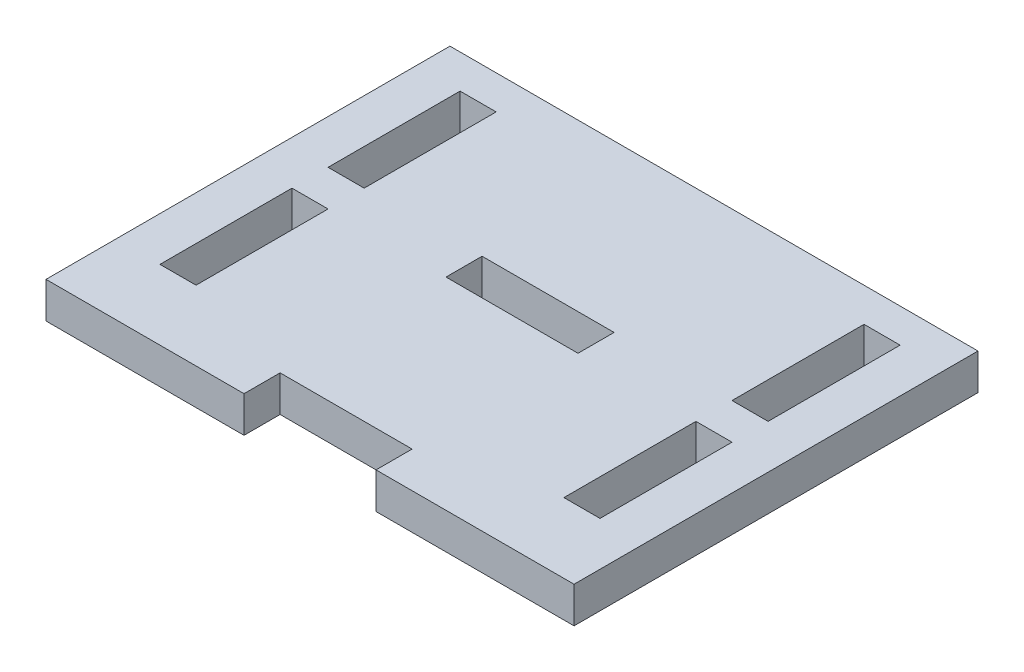
ISO-10303-21;
HEADER;
FILE_DESCRIPTION(('STEP AP214'),'2;1');
FILE_NAME('part.step','',(''),(''),'','','');
FILE_SCHEMA(('AUTOMOTIVE_DESIGN { 1 0 10303 214 1 1 1 1 }'));
ENDSEC;
DATA;
#1=APPLICATION_CONTEXT('core data for automotive mechanical design processes');
#2=APPLICATION_PROTOCOL_DEFINITION('international standard','automotive_design',2000,#1);
#3=PRODUCT_CONTEXT('',#1,'mechanical');
#4=PRODUCT('Part','Part','',(#3));
#5=PRODUCT_RELATED_PRODUCT_CATEGORY('part','',(#4));
#6=PRODUCT_DEFINITION_FORMATION('','',#4);
#7=PRODUCT_DEFINITION_CONTEXT('part definition',#1,'design');
#8=PRODUCT_DEFINITION('design','',#6,#7);
#9=PRODUCT_DEFINITION_SHAPE('','',#8);
#10=(LENGTH_UNIT() NAMED_UNIT(*) SI_UNIT(.MILLI.,.METRE.));
#11=(NAMED_UNIT(*) PLANE_ANGLE_UNIT() SI_UNIT($,.RADIAN.));
#12=(NAMED_UNIT(*) SI_UNIT($,.STERADIAN.) SOLID_ANGLE_UNIT());
#13=UNCERTAINTY_MEASURE_WITH_UNIT(LENGTH_MEASURE(1.E-05),#10,'distance_accuracy_value','');
#14=(GEOMETRIC_REPRESENTATION_CONTEXT(3) GLOBAL_UNCERTAINTY_ASSIGNED_CONTEXT((#13)) GLOBAL_UNIT_ASSIGNED_CONTEXT((#10,
#11,#12)) REPRESENTATION_CONTEXT('',''));
#15=CARTESIAN_POINT('',(0.,0.,0.));
#16=DIRECTION('',(0.,0.,1.));
#17=DIRECTION('',(1.,0.,0.));
#18=AXIS2_PLACEMENT_3D('',#15,#16,#17);
#19=CARTESIAN_POINT('',(0.,4.1,0.));
#20=DIRECTION('',(0.,1.,0.));
#21=DIRECTION('',(0.,0.,1.));
#22=AXIS2_PLACEMENT_3D('',#19,#20,#21);
#23=PLANE('',#22);
#24=DIRECTION('',(0.,0.,-1.));
#25=VECTOR('',#24,1.);
#26=CARTESIAN_POINT('',(55.,4.1,-7.94999999999999));
#27=LINE('',#26,#25);
#28=CARTESIAN_POINT('',(55.,4.1,-7.94999999999999));
#29=VERTEX_POINT('',#28);
#30=CARTESIAN_POINT('',(55.,4.1,-22.95));
#31=VERTEX_POINT('',#30);
#32=EDGE_CURVE('E255',#29,#31,#27,.T.);
#33=ORIENTED_EDGE('',*,*,#32,.F.);
#34=DIRECTION('',(1.,0.,0.));
#35=VECTOR('',#34,1.);
#36=CARTESIAN_POINT('',(55.,4.1,-7.94999999999999));
#37=LINE('',#36,#35);
#38=CARTESIAN_POINT('',(50.9,4.1,-7.94999999999999));
#39=VERTEX_POINT('',#38);
#40=EDGE_CURVE('E253',#39,#29,#37,.T.);
#41=ORIENTED_EDGE('',*,*,#40,.F.);
#42=DIRECTION('',(0.,0.,1.));
#43=VECTOR('',#42,1.);
#44=CARTESIAN_POINT('',(50.9,4.1,-7.94999999999999));
#45=LINE('',#44,#43);
#46=CARTESIAN_POINT('',(50.9,4.1,-22.95));
#47=VERTEX_POINT('',#46);
#48=EDGE_CURVE('E261',#47,#39,#45,.T.);
#49=ORIENTED_EDGE('',*,*,#48,.F.);
#50=DIRECTION('',(-1.,0.,0.));
#51=VECTOR('',#50,1.);
#52=CARTESIAN_POINT('',(55.,4.1,-22.95));
#53=LINE('',#52,#51);
#54=EDGE_CURVE('E258',#31,#47,#53,.T.);
#55=ORIENTED_EDGE('',*,*,#54,.F.);
#56=EDGE_LOOP('',(#33,#41,#49,#55));
#57=FACE_BOUND('',#56,.T.);
#58=DIRECTION('',(1.,0.,0.));
#59=VECTOR('',#58,1.);
#60=CARTESIAN_POINT('',(5.00000000000002,4.1,-7.94999999999999));
#61=LINE('',#60,#59);
#62=CARTESIAN_POINT('',(5.00000000000002,4.1,-7.94999999999999));
#63=VERTEX_POINT('',#62);
#64=CARTESIAN_POINT('',(9.10000000000001,4.1,-7.94999999999999));
#65=VERTEX_POINT('',#64);
#66=EDGE_CURVE('E317',#63,#65,#61,.T.);
#67=ORIENTED_EDGE('',*,*,#66,.F.);
#68=DIRECTION('',(0.,0.,1.));
#69=VECTOR('',#68,1.);
#70=CARTESIAN_POINT('',(5.00000000000002,4.1,-7.94999999999999));
#71=LINE('',#70,#69);
#72=CARTESIAN_POINT('',(5.,4.1,-22.95));
#73=VERTEX_POINT('',#72);
#74=EDGE_CURVE('E315',#73,#63,#71,.T.);
#75=ORIENTED_EDGE('',*,*,#74,.F.);
#76=DIRECTION('',(-1.,0.,0.));
#77=VECTOR('',#76,1.);
#78=CARTESIAN_POINT('',(5.,4.1,-22.95));
#79=LINE('',#78,#77);
#80=CARTESIAN_POINT('',(9.1,4.1,-22.95));
#81=VERTEX_POINT('',#80);
#82=EDGE_CURVE('E323',#81,#73,#79,.T.);
#83=ORIENTED_EDGE('',*,*,#82,.F.);
#84=DIRECTION('',(0.,0.,-1.));
#85=VECTOR('',#84,1.);
#86=CARTESIAN_POINT('',(9.10000000000001,4.1,-7.94999999999999));
#87=LINE('',#86,#85);
#88=EDGE_CURVE('E320',#65,#81,#87,.T.);
#89=ORIENTED_EDGE('',*,*,#88,.F.);
#90=EDGE_LOOP('',(#67,#75,#83,#89));
#91=FACE_BOUND('',#90,.T.);
#92=DIRECTION('',(1.,0.,0.));
#93=VECTOR('',#92,1.);
#94=CARTESIAN_POINT('',(22.5,4.1,0.));
#95=LINE('',#94,#93);
#96=CARTESIAN_POINT('',(0.,4.1,0.));
#97=VERTEX_POINT('',#96);
#98=CARTESIAN_POINT('',(22.5,4.1,0.));
#99=VERTEX_POINT('',#98);
#100=EDGE_CURVE('E377',#97,#99,#95,.T.);
#101=ORIENTED_EDGE('',*,*,#100,.T.);
#102=DIRECTION('',(0.,0.,-1.));
#103=VECTOR('',#102,1.);
#104=CARTESIAN_POINT('',(22.5,4.1,0.));
#105=LINE('',#104,#103);
#106=CARTESIAN_POINT('',(22.5,4.1,-4.1));
#107=VERTEX_POINT('',#106);
#108=EDGE_CURVE('E380',#99,#107,#105,.T.);
#109=ORIENTED_EDGE('',*,*,#108,.T.);
#110=DIRECTION('',(1.,0.,0.));
#111=VECTOR('',#110,1.);
#112=CARTESIAN_POINT('',(22.5,4.1,-4.1));
#113=LINE('',#112,#111);
#114=CARTESIAN_POINT('',(37.5,4.1,-4.1));
#115=VERTEX_POINT('',#114);
#116=EDGE_CURVE('E383',#107,#115,#113,.T.);
#117=ORIENTED_EDGE('',*,*,#116,.T.);
#118=DIRECTION('',(0.,0.,1.));
#119=VECTOR('',#118,1.);
#120=CARTESIAN_POINT('',(37.5,4.1,0.));
#121=LINE('',#120,#119);
#122=CARTESIAN_POINT('',(37.5,4.1,0.));
#123=VERTEX_POINT('',#122);
#124=EDGE_CURVE('E385',#115,#123,#121,.T.);
#125=ORIENTED_EDGE('',*,*,#124,.T.);
#126=DIRECTION('',(1.,0.,0.));
#127=VECTOR('',#126,1.);
#128=CARTESIAN_POINT('',(37.5,4.1,0.));
#129=LINE('',#128,#127);
#130=CARTESIAN_POINT('',(60.,4.1,0.));
#131=VERTEX_POINT('',#130);
#132=EDGE_CURVE('E387',#123,#131,#129,.T.);
#133=ORIENTED_EDGE('',*,*,#132,.T.);
#134=DIRECTION('',(0.,0.,-1.));
#135=VECTOR('',#134,1.);
#136=CARTESIAN_POINT('',(60.,4.1,0.));
#137=LINE('',#136,#135);
#138=CARTESIAN_POINT('',(60.,4.1,-45.9));
#139=VERTEX_POINT('',#138);
#140=EDGE_CURVE('E389',#131,#139,#137,.T.);
#141=ORIENTED_EDGE('',*,*,#140,.T.);
#142=DIRECTION('',(-1.,0.,0.));
#143=VECTOR('',#142,1.);
#144=CARTESIAN_POINT('',(0.,4.1,-45.9));
#145=LINE('',#144,#143);
#146=CARTESIAN_POINT('',(0.,4.1,-45.9));
#147=VERTEX_POINT('',#146);
#148=EDGE_CURVE('E391',#139,#147,#145,.T.);
#149=ORIENTED_EDGE('',*,*,#148,.T.);
#150=DIRECTION('',(0.,0.,1.));
#151=VECTOR('',#150,1.);
#152=CARTESIAN_POINT('',(0.,4.1,-45.9));
#153=LINE('',#152,#151);
#154=EDGE_CURVE('E393',#147,#97,#153,.T.);
#155=ORIENTED_EDGE('',*,*,#154,.T.);
#156=EDGE_LOOP('',(#101,#109,#117,#125,#133,#141,#149,#155));
#157=FACE_BOUND('',#156,.T.);
#158=DIRECTION('',(1.,0.,0.));
#159=VECTOR('',#158,1.);
#160=CARTESIAN_POINT('',(5.,4.1,-27.05));
#161=LINE('',#160,#159);
#162=CARTESIAN_POINT('',(5.,4.1,-27.05));
#163=VERTEX_POINT('',#162);
#164=CARTESIAN_POINT('',(9.1,4.1,-27.05));
#165=VERTEX_POINT('',#164);
#166=EDGE_CURVE('E348',#163,#165,#161,.T.);
#167=ORIENTED_EDGE('',*,*,#166,.F.);
#168=DIRECTION('',(0.,0.,1.));
#169=VECTOR('',#168,1.);
#170=CARTESIAN_POINT('',(5.,4.1,-42.05));
#171=LINE('',#170,#169);
#172=CARTESIAN_POINT('',(5.,4.1,-42.05));
#173=VERTEX_POINT('',#172);
#174=EDGE_CURVE('E346',#173,#163,#171,.T.);
#175=ORIENTED_EDGE('',*,*,#174,.F.);
#176=DIRECTION('',(-1.,0.,0.));
#177=VECTOR('',#176,1.);
#178=CARTESIAN_POINT('',(5.,4.1,-42.05));
#179=LINE('',#178,#177);
#180=CARTESIAN_POINT('',(9.1,4.1,-42.05));
#181=VERTEX_POINT('',#180);
#182=EDGE_CURVE('E354',#181,#173,#179,.T.);
#183=ORIENTED_EDGE('',*,*,#182,.F.);
#184=DIRECTION('',(0.,0.,-1.));
#185=VECTOR('',#184,1.);
#186=CARTESIAN_POINT('',(9.1,4.1,-42.05));
#187=LINE('',#186,#185);
#188=EDGE_CURVE('E351',#165,#181,#187,.T.);
#189=ORIENTED_EDGE('',*,*,#188,.F.);
#190=EDGE_LOOP('',(#167,#175,#183,#189));
#191=FACE_BOUND('',#190,.T.);
#192=DIRECTION('',(-1.,0.,0.));
#193=VECTOR('',#192,1.);
#194=CARTESIAN_POINT('',(55.,4.1,-42.05));
#195=LINE('',#194,#193);
#196=CARTESIAN_POINT('',(55.,4.1,-42.05));
#197=VERTEX_POINT('',#196);
#198=CARTESIAN_POINT('',(50.9,4.1,-42.05));
#199=VERTEX_POINT('',#198);
#200=EDGE_CURVE('E286',#197,#199,#195,.T.);
#201=ORIENTED_EDGE('',*,*,#200,.F.);
#202=DIRECTION('',(0.,0.,-1.));
#203=VECTOR('',#202,1.);
#204=CARTESIAN_POINT('',(55.,4.1,-42.05));
#205=LINE('',#204,#203);
#206=CARTESIAN_POINT('',(55.,4.1,-27.05));
#207=VERTEX_POINT('',#206);
#208=EDGE_CURVE('E284',#207,#197,#205,.T.);
#209=ORIENTED_EDGE('',*,*,#208,.F.);
#210=DIRECTION('',(1.,0.,0.));
#211=VECTOR('',#210,1.);
#212=CARTESIAN_POINT('',(55.,4.1,-27.05));
#213=LINE('',#212,#211);
#214=CARTESIAN_POINT('',(50.9,4.1,-27.05));
#215=VERTEX_POINT('',#214);
#216=EDGE_CURVE('E292',#215,#207,#213,.T.);
#217=ORIENTED_EDGE('',*,*,#216,.F.);
#218=DIRECTION('',(0.,0.,1.));
#219=VECTOR('',#218,1.);
#220=CARTESIAN_POINT('',(50.9,4.1,-42.05));
#221=LINE('',#220,#219);
#222=EDGE_CURVE('E289',#199,#215,#221,.T.);
#223=ORIENTED_EDGE('',*,*,#222,.F.);
#224=EDGE_LOOP('',(#201,#209,#217,#223));
#225=FACE_BOUND('',#224,.T.);
#226=DIRECTION('',(-1.,0.,0.));
#227=VECTOR('',#226,1.);
#228=CARTESIAN_POINT('',(22.5,4.1,-27.05));
#229=LINE('',#228,#227);
#230=CARTESIAN_POINT('',(37.5,4.1,-27.05));
#231=VERTEX_POINT('',#230);
#232=CARTESIAN_POINT('',(22.5,4.1,-27.05));
#233=VERTEX_POINT('',#232);
#234=EDGE_CURVE('E225',#231,#233,#229,.T.);
#235=ORIENTED_EDGE('',*,*,#234,.F.);
#236=DIRECTION('',(0.,0.,-1.));
#237=VECTOR('',#236,1.);
#238=CARTESIAN_POINT('',(37.5,4.1,-22.95));
#239=LINE('',#238,#237);
#240=CARTESIAN_POINT('',(37.5,4.1,-22.95));
#241=VERTEX_POINT('',#240);
#242=EDGE_CURVE('E217',#241,#231,#239,.T.);
#243=ORIENTED_EDGE('',*,*,#242,.F.);
#244=DIRECTION('',(1.,0.,0.));
#245=VECTOR('',#244,1.);
#246=CARTESIAN_POINT('',(22.5,4.1,-22.95));
#247=LINE('',#246,#245);
#248=CARTESIAN_POINT('',(22.5,4.1,-22.95));
#249=VERTEX_POINT('',#248);
#250=EDGE_CURVE('E239',#249,#241,#247,.T.);
#251=ORIENTED_EDGE('',*,*,#250,.F.);
#252=DIRECTION('',(0.,0.,1.));
#253=VECTOR('',#252,1.);
#254=CARTESIAN_POINT('',(22.5,4.1,-22.95));
#255=LINE('',#254,#253);
#256=EDGE_CURVE('E237',#233,#249,#255,.T.);
#257=ORIENTED_EDGE('',*,*,#256,.F.);
#258=EDGE_LOOP('',(#235,#243,#251,#257));
#259=FACE_BOUND('',#258,.T.);
#260=ADVANCED_FACE('F32',(#57,#91,#157,#191,#225,#259),#23,.T.);
#261=CARTESIAN_POINT('',(0.,0.,0.));
#262=DIRECTION('',(0.,1.,0.));
#263=DIRECTION('',(0.,0.,1.));
#264=AXIS2_PLACEMENT_3D('',#261,#262,#263);
#265=PLANE('',#264);
#266=DIRECTION('',(1.,0.,0.));
#267=VECTOR('',#266,1.);
#268=CARTESIAN_POINT('',(55.,0.,-7.94999999999999));
#269=LINE('',#268,#267);
#270=CARTESIAN_POINT('',(50.9,0.,-7.94999999999999));
#271=VERTEX_POINT('',#270);
#272=CARTESIAN_POINT('',(55.,0.,-7.94999999999999));
#273=VERTEX_POINT('',#272);
#274=EDGE_CURVE('E233',#271,#273,#269,.T.);
#275=ORIENTED_EDGE('',*,*,#274,.T.);
#276=DIRECTION('',(0.,0.,-1.));
#277=VECTOR('',#276,1.);
#278=CARTESIAN_POINT('',(55.,0.,-7.94999999999999));
#279=LINE('',#278,#277);
#280=CARTESIAN_POINT('',(55.,0.,-22.95));
#281=VERTEX_POINT('',#280);
#282=EDGE_CURVE('E266',#273,#281,#279,.T.);
#283=ORIENTED_EDGE('',*,*,#282,.T.);
#284=DIRECTION('',(-1.,0.,0.));
#285=VECTOR('',#284,1.);
#286=CARTESIAN_POINT('',(55.,0.,-22.95));
#287=LINE('',#286,#285);
#288=CARTESIAN_POINT('',(50.9,0.,-22.95));
#289=VERTEX_POINT('',#288);
#290=EDGE_CURVE('E269',#281,#289,#287,.T.);
#291=ORIENTED_EDGE('',*,*,#290,.T.);
#292=DIRECTION('',(0.,0.,1.));
#293=VECTOR('',#292,1.);
#294=CARTESIAN_POINT('',(50.9,0.,-7.94999999999999));
#295=LINE('',#294,#293);
#296=EDGE_CURVE('E256',#289,#271,#295,.T.);
#297=ORIENTED_EDGE('',*,*,#296,.T.);
#298=EDGE_LOOP('',(#275,#283,#291,#297));
#299=FACE_BOUND('',#298,.T.);
#300=DIRECTION('',(0.,0.,1.));
#301=VECTOR('',#300,1.);
#302=CARTESIAN_POINT('',(5.00000000000002,0.,-7.94999999999999));
#303=LINE('',#302,#301);
#304=CARTESIAN_POINT('',(5.,0.,-22.95));
#305=VERTEX_POINT('',#304);
#306=CARTESIAN_POINT('',(5.00000000000002,0.,-7.94999999999999));
#307=VERTEX_POINT('',#306);
#308=EDGE_CURVE('E314',#305,#307,#303,.T.);
#309=ORIENTED_EDGE('',*,*,#308,.T.);
#310=DIRECTION('',(1.,0.,0.));
#311=VECTOR('',#310,1.);
#312=CARTESIAN_POINT('',(5.00000000000002,0.,-7.94999999999999));
#313=LINE('',#312,#311);
#314=CARTESIAN_POINT('',(9.10000000000001,0.,-7.94999999999999));
#315=VERTEX_POINT('',#314);
#316=EDGE_CURVE('E328',#307,#315,#313,.T.);
#317=ORIENTED_EDGE('',*,*,#316,.T.);
#318=DIRECTION('',(0.,0.,-1.));
#319=VECTOR('',#318,1.);
#320=CARTESIAN_POINT('',(9.10000000000001,0.,-7.94999999999999));
#321=LINE('',#320,#319);
#322=CARTESIAN_POINT('',(9.1,0.,-22.95));
#323=VERTEX_POINT('',#322);
#324=EDGE_CURVE('E331',#315,#323,#321,.T.);
#325=ORIENTED_EDGE('',*,*,#324,.T.);
#326=DIRECTION('',(-1.,0.,0.));
#327=VECTOR('',#326,1.);
#328=CARTESIAN_POINT('',(5.,0.,-22.95));
#329=LINE('',#328,#327);
#330=EDGE_CURVE('E318',#323,#305,#329,.T.);
#331=ORIENTED_EDGE('',*,*,#330,.T.);
#332=EDGE_LOOP('',(#309,#317,#325,#331));
#333=FACE_BOUND('',#332,.T.);
#334=DIRECTION('',(1.,0.,0.));
#335=VECTOR('',#334,1.);
#336=CARTESIAN_POINT('',(22.5,0.,0.));
#337=LINE('',#336,#335);
#338=CARTESIAN_POINT('',(0.,0.,0.));
#339=VERTEX_POINT('',#338);
#340=CARTESIAN_POINT('',(22.5,0.,0.));
#341=VERTEX_POINT('',#340);
#342=EDGE_CURVE('E376',#339,#341,#337,.T.);
#343=ORIENTED_EDGE('',*,*,#342,.F.);
#344=DIRECTION('',(0.,0.,1.));
#345=VECTOR('',#344,1.);
#346=CARTESIAN_POINT('',(0.,0.,-45.9));
#347=LINE('',#346,#345);
#348=CARTESIAN_POINT('',(0.,0.,-45.9));
#349=VERTEX_POINT('',#348);
#350=EDGE_CURVE('E381',#349,#339,#347,.T.);
#351=ORIENTED_EDGE('',*,*,#350,.F.);
#352=DIRECTION('',(-1.,0.,0.));
#353=VECTOR('',#352,1.);
#354=CARTESIAN_POINT('',(0.,0.,-45.9));
#355=LINE('',#354,#353);
#356=CARTESIAN_POINT('',(60.,0.,-45.9));
#357=VERTEX_POINT('',#356);
#358=EDGE_CURVE('E408',#357,#349,#355,.T.);
#359=ORIENTED_EDGE('',*,*,#358,.F.);
#360=DIRECTION('',(0.,0.,-1.));
#361=VECTOR('',#360,1.);
#362=CARTESIAN_POINT('',(60.,0.,0.));
#363=LINE('',#362,#361);
#364=CARTESIAN_POINT('',(60.,0.,0.));
#365=VERTEX_POINT('',#364);
#366=EDGE_CURVE('E406',#365,#357,#363,.T.);
#367=ORIENTED_EDGE('',*,*,#366,.F.);
#368=DIRECTION('',(1.,0.,0.));
#369=VECTOR('',#368,1.);
#370=CARTESIAN_POINT('',(37.5,0.,0.));
#371=LINE('',#370,#369);
#372=CARTESIAN_POINT('',(37.5,0.,0.));
#373=VERTEX_POINT('',#372);
#374=EDGE_CURVE('E404',#373,#365,#371,.T.);
#375=ORIENTED_EDGE('',*,*,#374,.F.);
#376=DIRECTION('',(0.,0.,1.));
#377=VECTOR('',#376,1.);
#378=CARTESIAN_POINT('',(37.5,0.,0.));
#379=LINE('',#378,#377);
#380=CARTESIAN_POINT('',(37.5,0.,-4.1));
#381=VERTEX_POINT('',#380);
#382=EDGE_CURVE('E402',#381,#373,#379,.T.);
#383=ORIENTED_EDGE('',*,*,#382,.F.);
#384=DIRECTION('',(1.,0.,0.));
#385=VECTOR('',#384,1.);
#386=CARTESIAN_POINT('',(22.5,0.,-4.1));
#387=LINE('',#386,#385);
#388=CARTESIAN_POINT('',(22.5,0.,-4.1));
#389=VERTEX_POINT('',#388);
#390=EDGE_CURVE('E400',#389,#381,#387,.T.);
#391=ORIENTED_EDGE('',*,*,#390,.F.);
#392=DIRECTION('',(0.,0.,-1.));
#393=VECTOR('',#392,1.);
#394=CARTESIAN_POINT('',(22.5,0.,0.));
#395=LINE('',#394,#393);
#396=EDGE_CURVE('E398',#341,#389,#395,.T.);
#397=ORIENTED_EDGE('',*,*,#396,.F.);
#398=EDGE_LOOP('',(#343,#351,#359,#367,#375,#383,#391,#397));
#399=FACE_BOUND('',#398,.T.);
#400=DIRECTION('',(0.,0.,1.));
#401=VECTOR('',#400,1.);
#402=CARTESIAN_POINT('',(5.,0.,-42.05));
#403=LINE('',#402,#401);
#404=CARTESIAN_POINT('',(5.,0.,-42.05));
#405=VERTEX_POINT('',#404);
#406=CARTESIAN_POINT('',(5.,0.,-27.05));
#407=VERTEX_POINT('',#406);
#408=EDGE_CURVE('E345',#405,#407,#403,.T.);
#409=ORIENTED_EDGE('',*,*,#408,.T.);
#410=DIRECTION('',(1.,0.,0.));
#411=VECTOR('',#410,1.);
#412=CARTESIAN_POINT('',(5.,0.,-27.05));
#413=LINE('',#412,#411);
#414=CARTESIAN_POINT('',(9.1,0.,-27.05));
#415=VERTEX_POINT('',#414);
#416=EDGE_CURVE('E359',#407,#415,#413,.T.);
#417=ORIENTED_EDGE('',*,*,#416,.T.);
#418=DIRECTION('',(0.,0.,-1.));
#419=VECTOR('',#418,1.);
#420=CARTESIAN_POINT('',(9.1,0.,-42.05));
#421=LINE('',#420,#419);
#422=CARTESIAN_POINT('',(9.1,0.,-42.05));
#423=VERTEX_POINT('',#422);
#424=EDGE_CURVE('E362',#415,#423,#421,.T.);
#425=ORIENTED_EDGE('',*,*,#424,.T.);
#426=DIRECTION('',(-1.,0.,0.));
#427=VECTOR('',#426,1.);
#428=CARTESIAN_POINT('',(5.,0.,-42.05));
#429=LINE('',#428,#427);
#430=EDGE_CURVE('E349',#423,#405,#429,.T.);
#431=ORIENTED_EDGE('',*,*,#430,.T.);
#432=EDGE_LOOP('',(#409,#417,#425,#431));
#433=FACE_BOUND('',#432,.T.);
#434=DIRECTION('',(0.,0.,-1.));
#435=VECTOR('',#434,1.);
#436=CARTESIAN_POINT('',(55.,0.,-42.05));
#437=LINE('',#436,#435);
#438=CARTESIAN_POINT('',(55.,0.,-27.05));
#439=VERTEX_POINT('',#438);
#440=CARTESIAN_POINT('',(55.,0.,-42.05));
#441=VERTEX_POINT('',#440);
#442=EDGE_CURVE('E283',#439,#441,#437,.T.);
#443=ORIENTED_EDGE('',*,*,#442,.T.);
#444=DIRECTION('',(-1.,0.,0.));
#445=VECTOR('',#444,1.);
#446=CARTESIAN_POINT('',(55.,0.,-42.05));
#447=LINE('',#446,#445);
#448=CARTESIAN_POINT('',(50.9,0.,-42.05));
#449=VERTEX_POINT('',#448);
#450=EDGE_CURVE('E297',#441,#449,#447,.T.);
#451=ORIENTED_EDGE('',*,*,#450,.T.);
#452=DIRECTION('',(0.,0.,1.));
#453=VECTOR('',#452,1.);
#454=CARTESIAN_POINT('',(50.9,0.,-42.05));
#455=LINE('',#454,#453);
#456=CARTESIAN_POINT('',(50.9,0.,-27.05));
#457=VERTEX_POINT('',#456);
#458=EDGE_CURVE('E300',#449,#457,#455,.T.);
#459=ORIENTED_EDGE('',*,*,#458,.T.);
#460=DIRECTION('',(1.,0.,0.));
#461=VECTOR('',#460,1.);
#462=CARTESIAN_POINT('',(55.,0.,-27.05));
#463=LINE('',#462,#461);
#464=EDGE_CURVE('E287',#457,#439,#463,.T.);
#465=ORIENTED_EDGE('',*,*,#464,.T.);
#466=EDGE_LOOP('',(#443,#451,#459,#465));
#467=FACE_BOUND('',#466,.T.);
#468=DIRECTION('',(0.,0.,-1.));
#469=VECTOR('',#468,1.);
#470=CARTESIAN_POINT('',(37.5,0.,-22.95));
#471=LINE('',#470,#469);
#472=CARTESIAN_POINT('',(37.5,0.,-22.95));
#473=VERTEX_POINT('',#472);
#474=CARTESIAN_POINT('',(37.5,0.,-27.05));
#475=VERTEX_POINT('',#474);
#476=EDGE_CURVE('E55',#473,#475,#471,.T.);
#477=ORIENTED_EDGE('',*,*,#476,.T.);
#478=DIRECTION('',(-1.,0.,0.));
#479=VECTOR('',#478,1.);
#480=CARTESIAN_POINT('',(22.5,0.,-27.05));
#481=LINE('',#480,#479);
#482=CARTESIAN_POINT('',(22.5,0.,-27.05));
#483=VERTEX_POINT('',#482);
#484=EDGE_CURVE('E232',#475,#483,#481,.T.);
#485=ORIENTED_EDGE('',*,*,#484,.T.);
#486=DIRECTION('',(0.,0.,1.));
#487=VECTOR('',#486,1.);
#488=CARTESIAN_POINT('',(22.5,0.,-22.95));
#489=LINE('',#488,#487);
#490=CARTESIAN_POINT('',(22.5,0.,-22.95));
#491=VERTEX_POINT('',#490);
#492=EDGE_CURVE('E245',#483,#491,#489,.T.);
#493=ORIENTED_EDGE('',*,*,#492,.T.);
#494=DIRECTION('',(1.,0.,0.));
#495=VECTOR('',#494,1.);
#496=CARTESIAN_POINT('',(22.5,0.,-22.95));
#497=LINE('',#496,#495);
#498=EDGE_CURVE('E226',#491,#473,#497,.T.);
#499=ORIENTED_EDGE('',*,*,#498,.T.);
#500=EDGE_LOOP('',(#477,#485,#493,#499));
#501=FACE_BOUND('',#500,.T.);
#502=ADVANCED_FACE('F438',(#299,#333,#399,#433,#467,#501),#265,.F.);
#503=CARTESIAN_POINT('',(22.5,4.1,0.));
#504=DIRECTION('',(0.,0.,-1.));
#505=DIRECTION('',(-1.,0.,0.));
#506=AXIS2_PLACEMENT_3D('',#503,#504,#505);
#507=PLANE('',#506);
#508=ORIENTED_EDGE('',*,*,#342,.T.);
#509=DIRECTION('',(0.,-1.,0.));
#510=VECTOR('',#509,1.);
#511=CARTESIAN_POINT('',(22.5,4.1,0.));
#512=LINE('',#511,#510);
#513=EDGE_CURVE('E11',#99,#341,#512,.T.);
#514=ORIENTED_EDGE('',*,*,#513,.F.);
#515=ORIENTED_EDGE('',*,*,#100,.F.);
#516=DIRECTION('',(0.,-1.,0.));
#517=VECTOR('',#516,1.);
#518=CARTESIAN_POINT('',(0.,4.1,0.));
#519=LINE('',#518,#517);
#520=EDGE_CURVE('E395',#97,#339,#519,.T.);
#521=ORIENTED_EDGE('',*,*,#520,.T.);
#522=EDGE_LOOP('',(#508,#514,#515,#521));
#523=FACE_BOUND('',#522,.T.);
#524=ADVANCED_FACE('F34',(#523),#507,.F.);
#525=CARTESIAN_POINT('',(22.5,4.1,0.));
#526=DIRECTION('',(-1.,0.,0.));
#527=DIRECTION('',(0.,0.,1.));
#528=AXIS2_PLACEMENT_3D('',#525,#526,#527);
#529=PLANE('',#528);
#530=ORIENTED_EDGE('',*,*,#396,.T.);
#531=DIRECTION('',(0.,-1.,0.));
#532=VECTOR('',#531,1.);
#533=CARTESIAN_POINT('',(22.5,4.1,-4.1));
#534=LINE('',#533,#532);
#535=EDGE_CURVE('E40',#107,#389,#534,.T.);
#536=ORIENTED_EDGE('',*,*,#535,.F.);
#537=ORIENTED_EDGE('',*,*,#108,.F.);
#538=ORIENTED_EDGE('',*,*,#513,.T.);
#539=EDGE_LOOP('',(#530,#536,#537,#538));
#540=FACE_BOUND('',#539,.T.);
#541=ADVANCED_FACE('F456',(#540),#529,.F.);
#542=CARTESIAN_POINT('',(22.5,4.1,-4.1));
#543=DIRECTION('',(0.,0.,-1.));
#544=DIRECTION('',(-1.,0.,0.));
#545=AXIS2_PLACEMENT_3D('',#542,#543,#544);
#546=PLANE('',#545);
#547=ORIENTED_EDGE('',*,*,#390,.T.);
#548=DIRECTION('',(0.,-1.,0.));
#549=VECTOR('',#548,1.);
#550=CARTESIAN_POINT('',(37.5,4.1,-4.1));
#551=LINE('',#550,#549);
#552=EDGE_CURVE('E425',#115,#381,#551,.T.);
#553=ORIENTED_EDGE('',*,*,#552,.F.);
#554=ORIENTED_EDGE('',*,*,#116,.F.);
#555=ORIENTED_EDGE('',*,*,#535,.T.);
#556=EDGE_LOOP('',(#547,#553,#554,#555));
#557=FACE_BOUND('',#556,.T.);
#558=ADVANCED_FACE('F432',(#557),#546,.F.);
#559=CARTESIAN_POINT('',(37.5,4.1,0.));
#560=DIRECTION('',(1.,0.,0.));
#561=DIRECTION('',(0.,0.,-1.));
#562=AXIS2_PLACEMENT_3D('',#559,#560,#561);
#563=PLANE('',#562);
#564=ORIENTED_EDGE('',*,*,#382,.T.);
#565=DIRECTION('',(0.,-1.,0.));
#566=VECTOR('',#565,1.);
#567=CARTESIAN_POINT('',(37.5,4.1,0.));
#568=LINE('',#567,#566);
#569=EDGE_CURVE('E422',#123,#373,#568,.T.);
#570=ORIENTED_EDGE('',*,*,#569,.F.);
#571=ORIENTED_EDGE('',*,*,#124,.F.);
#572=ORIENTED_EDGE('',*,*,#552,.T.);
#573=EDGE_LOOP('',(#564,#570,#571,#572));
#574=FACE_BOUND('',#573,.T.);
#575=ADVANCED_FACE('F444',(#574),#563,.F.);
#576=CARTESIAN_POINT('',(37.5,4.1,0.));
#577=DIRECTION('',(0.,0.,-1.));
#578=DIRECTION('',(-1.,0.,0.));
#579=AXIS2_PLACEMENT_3D('',#576,#577,#578);
#580=PLANE('',#579);
#581=ORIENTED_EDGE('',*,*,#374,.T.);
#582=DIRECTION('',(0.,-1.,0.));
#583=VECTOR('',#582,1.);
#584=CARTESIAN_POINT('',(60.,4.1,0.));
#585=LINE('',#584,#583);
#586=EDGE_CURVE('E419',#131,#365,#585,.T.);
#587=ORIENTED_EDGE('',*,*,#586,.F.);
#588=ORIENTED_EDGE('',*,*,#132,.F.);
#589=ORIENTED_EDGE('',*,*,#569,.T.);
#590=EDGE_LOOP('',(#581,#587,#588,#589));
#591=FACE_BOUND('',#590,.T.);
#592=ADVANCED_FACE('F448',(#591),#580,.F.);
#593=CARTESIAN_POINT('',(60.,4.1,0.));
#594=DIRECTION('',(-1.,0.,0.));
#595=DIRECTION('',(0.,0.,1.));
#596=AXIS2_PLACEMENT_3D('',#593,#594,#595);
#597=PLANE('',#596);
#598=ORIENTED_EDGE('',*,*,#366,.T.);
#599=DIRECTION('',(0.,-1.,0.));
#600=VECTOR('',#599,1.);
#601=CARTESIAN_POINT('',(60.,4.1,-45.9));
#602=LINE('',#601,#600);
#603=EDGE_CURVE('E416',#139,#357,#602,.T.);
#604=ORIENTED_EDGE('',*,*,#603,.F.);
#605=ORIENTED_EDGE('',*,*,#140,.F.);
#606=ORIENTED_EDGE('',*,*,#586,.T.);
#607=EDGE_LOOP('',(#598,#604,#605,#606));
#608=FACE_BOUND('',#607,.T.);
#609=ADVANCED_FACE('F469',(#608),#597,.F.);
#610=CARTESIAN_POINT('',(0.,4.1,-45.9));
#611=DIRECTION('',(0.,0.,1.));
#612=DIRECTION('',(1.,0.,0.));
#613=AXIS2_PLACEMENT_3D('',#610,#611,#612);
#614=PLANE('',#613);
#615=ORIENTED_EDGE('',*,*,#358,.T.);
#616=DIRECTION('',(0.,-1.,0.));
#617=VECTOR('',#616,1.);
#618=CARTESIAN_POINT('',(0.,4.1,-45.9));
#619=LINE('',#618,#617);
#620=EDGE_CURVE('E413',#147,#349,#619,.T.);
#621=ORIENTED_EDGE('',*,*,#620,.F.);
#622=ORIENTED_EDGE('',*,*,#148,.F.);
#623=ORIENTED_EDGE('',*,*,#603,.T.);
#624=EDGE_LOOP('',(#615,#621,#622,#623));
#625=FACE_BOUND('',#624,.T.);
#626=ADVANCED_FACE('F467',(#625),#614,.F.);
#627=CARTESIAN_POINT('',(0.,4.1,-45.9));
#628=DIRECTION('',(1.,0.,0.));
#629=DIRECTION('',(0.,0.,-1.));
#630=AXIS2_PLACEMENT_3D('',#627,#628,#629);
#631=PLANE('',#630);
#632=ORIENTED_EDGE('',*,*,#350,.T.);
#633=ORIENTED_EDGE('',*,*,#520,.F.);
#634=ORIENTED_EDGE('',*,*,#154,.F.);
#635=ORIENTED_EDGE('',*,*,#620,.T.);
#636=EDGE_LOOP('',(#632,#633,#634,#635));
#637=FACE_BOUND('',#636,.T.);
#638=ADVANCED_FACE('F462',(#637),#631,.F.);
#639=CARTESIAN_POINT('',(5.,4.1,-42.05));
#640=DIRECTION('',(1.,0.,0.));
#641=DIRECTION('',(0.,0.,-1.));
#642=AXIS2_PLACEMENT_3D('',#639,#640,#641);
#643=PLANE('',#642);
#644=ORIENTED_EDGE('',*,*,#408,.F.);
#645=DIRECTION('',(0.,-1.,0.));
#646=VECTOR('',#645,1.);
#647=CARTESIAN_POINT('',(5.,4.1,-42.05));
#648=LINE('',#647,#646);
#649=EDGE_CURVE('E356',#173,#405,#648,.T.);
#650=ORIENTED_EDGE('',*,*,#649,.F.);
#651=ORIENTED_EDGE('',*,*,#174,.T.);
#652=DIRECTION('',(0.,-1.,0.));
#653=VECTOR('',#652,1.);
#654=CARTESIAN_POINT('',(5.,4.1,-27.05));
#655=LINE('',#654,#653);
#656=EDGE_CURVE('E373',#163,#407,#655,.T.);
#657=ORIENTED_EDGE('',*,*,#656,.T.);
#658=EDGE_LOOP('',(#644,#650,#651,#657));
#659=FACE_BOUND('',#658,.T.);
#660=ADVANCED_FACE('F489',(#659),#643,.T.);
#661=CARTESIAN_POINT('',(5.,4.1,-27.05));
#662=DIRECTION('',(0.,0.,-1.));
#663=DIRECTION('',(-1.,0.,0.));
#664=AXIS2_PLACEMENT_3D('',#661,#662,#663);
#665=PLANE('',#664);
#666=ORIENTED_EDGE('',*,*,#416,.F.);
#667=ORIENTED_EDGE('',*,*,#656,.F.);
#668=ORIENTED_EDGE('',*,*,#166,.T.);
#669=DIRECTION('',(0.,-1.,0.));
#670=VECTOR('',#669,1.);
#671=CARTESIAN_POINT('',(9.1,4.1,-27.05));
#672=LINE('',#671,#670);
#673=EDGE_CURVE('E371',#165,#415,#672,.T.);
#674=ORIENTED_EDGE('',*,*,#673,.T.);
#675=EDGE_LOOP('',(#666,#667,#668,#674));
#676=FACE_BOUND('',#675,.T.);
#677=ADVANCED_FACE('F496',(#676),#665,.T.);
#678=CARTESIAN_POINT('',(9.1,4.1,-42.05));
#679=DIRECTION('',(-1.,0.,0.));
#680=DIRECTION('',(0.,0.,1.));
#681=AXIS2_PLACEMENT_3D('',#678,#679,#680);
#682=PLANE('',#681);
#683=ORIENTED_EDGE('',*,*,#424,.F.);
#684=ORIENTED_EDGE('',*,*,#673,.F.);
#685=ORIENTED_EDGE('',*,*,#188,.T.);
#686=DIRECTION('',(0.,-1.,0.));
#687=VECTOR('',#686,1.);
#688=CARTESIAN_POINT('',(9.1,4.1,-42.05));
#689=LINE('',#688,#687);
#690=EDGE_CURVE('E369',#181,#423,#689,.T.);
#691=ORIENTED_EDGE('',*,*,#690,.T.);
#692=EDGE_LOOP('',(#683,#684,#685,#691));
#693=FACE_BOUND('',#692,.T.);
#694=ADVANCED_FACE('F501',(#693),#682,.T.);
#695=CARTESIAN_POINT('',(5.,4.1,-42.05));
#696=DIRECTION('',(0.,0.,1.));
#697=DIRECTION('',(1.,0.,0.));
#698=AXIS2_PLACEMENT_3D('',#695,#696,#697);
#699=PLANE('',#698);
#700=ORIENTED_EDGE('',*,*,#430,.F.);
#701=ORIENTED_EDGE('',*,*,#690,.F.);
#702=ORIENTED_EDGE('',*,*,#182,.T.);
#703=ORIENTED_EDGE('',*,*,#649,.T.);
#704=EDGE_LOOP('',(#700,#701,#702,#703));
#705=FACE_BOUND('',#704,.T.);
#706=ADVANCED_FACE('F508',(#705),#699,.T.);
#707=CARTESIAN_POINT('',(5.00000000000002,4.1,-7.94999999999999));
#708=DIRECTION('',(1.,0.,0.));
#709=DIRECTION('',(0.,0.,-1.));
#710=AXIS2_PLACEMENT_3D('',#707,#708,#709);
#711=PLANE('',#710);
#712=ORIENTED_EDGE('',*,*,#308,.F.);
#713=DIRECTION('',(0.,-1.,0.));
#714=VECTOR('',#713,1.);
#715=CARTESIAN_POINT('',(5.,4.1,-22.95));
#716=LINE('',#715,#714);
#717=EDGE_CURVE('E325',#73,#305,#716,.T.);
#718=ORIENTED_EDGE('',*,*,#717,.F.);
#719=ORIENTED_EDGE('',*,*,#74,.T.);
#720=DIRECTION('',(0.,-1.,0.));
#721=VECTOR('',#720,1.);
#722=CARTESIAN_POINT('',(5.00000000000002,4.1,-7.94999999999999));
#723=LINE('',#722,#721);
#724=EDGE_CURVE('E342',#63,#307,#723,.T.);
#725=ORIENTED_EDGE('',*,*,#724,.T.);
#726=EDGE_LOOP('',(#712,#718,#719,#725));
#727=FACE_BOUND('',#726,.T.);
#728=ADVANCED_FACE('F563',(#727),#711,.T.);
#729=CARTESIAN_POINT('',(5.00000000000002,4.1,-7.94999999999999));
#730=DIRECTION('',(0.,0.,-1.));
#731=DIRECTION('',(-1.,0.,0.));
#732=AXIS2_PLACEMENT_3D('',#729,#730,#731);
#733=PLANE('',#732);
#734=ORIENTED_EDGE('',*,*,#316,.F.);
#735=ORIENTED_EDGE('',*,*,#724,.F.);
#736=ORIENTED_EDGE('',*,*,#66,.T.);
#737=DIRECTION('',(0.,-1.,0.));
#738=VECTOR('',#737,1.);
#739=CARTESIAN_POINT('',(9.10000000000001,4.1,-7.94999999999999));
#740=LINE('',#739,#738);
#741=EDGE_CURVE('E340',#65,#315,#740,.T.);
#742=ORIENTED_EDGE('',*,*,#741,.T.);
#743=EDGE_LOOP('',(#734,#735,#736,#742));
#744=FACE_BOUND('',#743,.T.);
#745=ADVANCED_FACE('F559',(#744),#733,.T.);
#746=CARTESIAN_POINT('',(9.10000000000001,4.1,-7.94999999999999));
#747=DIRECTION('',(-1.,0.,0.));
#748=DIRECTION('',(0.,0.,1.));
#749=AXIS2_PLACEMENT_3D('',#746,#747,#748);
#750=PLANE('',#749);
#751=ORIENTED_EDGE('',*,*,#324,.F.);
#752=ORIENTED_EDGE('',*,*,#741,.F.);
#753=ORIENTED_EDGE('',*,*,#88,.T.);
#754=DIRECTION('',(0.,-1.,0.));
#755=VECTOR('',#754,1.);
#756=CARTESIAN_POINT('',(9.1,4.1,-22.95));
#757=LINE('',#756,#755);
#758=EDGE_CURVE('E338',#81,#323,#757,.T.);
#759=ORIENTED_EDGE('',*,*,#758,.T.);
#760=EDGE_LOOP('',(#751,#752,#753,#759));
#761=FACE_BOUND('',#760,.T.);
#762=ADVANCED_FACE('F555',(#761),#750,.T.);
#763=CARTESIAN_POINT('',(5.,4.1,-22.95));
#764=DIRECTION('',(0.,0.,1.));
#765=DIRECTION('',(1.,0.,0.));
#766=AXIS2_PLACEMENT_3D('',#763,#764,#765);
#767=PLANE('',#766);
#768=ORIENTED_EDGE('',*,*,#330,.F.);
#769=ORIENTED_EDGE('',*,*,#758,.F.);
#770=ORIENTED_EDGE('',*,*,#82,.T.);
#771=ORIENTED_EDGE('',*,*,#717,.T.);
#772=EDGE_LOOP('',(#768,#769,#770,#771));
#773=FACE_BOUND('',#772,.T.);
#774=ADVANCED_FACE('F552',(#773),#767,.T.);
#775=CARTESIAN_POINT('',(55.,4.1,-42.05));
#776=DIRECTION('',(-1.,0.,0.));
#777=DIRECTION('',(0.,0.,1.));
#778=AXIS2_PLACEMENT_3D('',#775,#776,#777);
#779=PLANE('',#778);
#780=ORIENTED_EDGE('',*,*,#442,.F.);
#781=DIRECTION('',(0.,-1.,0.));
#782=VECTOR('',#781,1.);
#783=CARTESIAN_POINT('',(55.,4.1,-27.05));
#784=LINE('',#783,#782);
#785=EDGE_CURVE('E294',#207,#439,#784,.T.);
#786=ORIENTED_EDGE('',*,*,#785,.F.);
#787=ORIENTED_EDGE('',*,*,#208,.T.);
#788=DIRECTION('',(0.,-1.,0.));
#789=VECTOR('',#788,1.);
#790=CARTESIAN_POINT('',(55.,4.1,-42.05));
#791=LINE('',#790,#789);
#792=EDGE_CURVE('E311',#197,#441,#791,.T.);
#793=ORIENTED_EDGE('',*,*,#792,.T.);
#794=EDGE_LOOP('',(#780,#786,#787,#793));
#795=FACE_BOUND('',#794,.T.);
#796=ADVANCED_FACE('F531',(#795),#779,.T.);
#797=CARTESIAN_POINT('',(55.,4.1,-42.05));
#798=DIRECTION('',(0.,0.,1.));
#799=DIRECTION('',(1.,0.,0.));
#800=AXIS2_PLACEMENT_3D('',#797,#798,#799);
#801=PLANE('',#800);
#802=ORIENTED_EDGE('',*,*,#450,.F.);
#803=ORIENTED_EDGE('',*,*,#792,.F.);
#804=ORIENTED_EDGE('',*,*,#200,.T.);
#805=DIRECTION('',(0.,-1.,0.));
#806=VECTOR('',#805,1.);
#807=CARTESIAN_POINT('',(50.9,4.1,-42.05));
#808=LINE('',#807,#806);
#809=EDGE_CURVE('E309',#199,#449,#808,.T.);
#810=ORIENTED_EDGE('',*,*,#809,.T.);
#811=EDGE_LOOP('',(#802,#803,#804,#810));
#812=FACE_BOUND('',#811,.T.);
#813=ADVANCED_FACE('F524',(#812),#801,.T.);
#814=CARTESIAN_POINT('',(50.9,4.1,-42.05));
#815=DIRECTION('',(1.,0.,0.));
#816=DIRECTION('',(0.,0.,-1.));
#817=AXIS2_PLACEMENT_3D('',#814,#815,#816);
#818=PLANE('',#817);
#819=ORIENTED_EDGE('',*,*,#458,.F.);
#820=ORIENTED_EDGE('',*,*,#809,.F.);
#821=ORIENTED_EDGE('',*,*,#222,.T.);
#822=DIRECTION('',(0.,-1.,0.));
#823=VECTOR('',#822,1.);
#824=CARTESIAN_POINT('',(50.9,4.1,-27.05));
#825=LINE('',#824,#823);
#826=EDGE_CURVE('E307',#215,#457,#825,.T.);
#827=ORIENTED_EDGE('',*,*,#826,.T.);
#828=EDGE_LOOP('',(#819,#820,#821,#827));
#829=FACE_BOUND('',#828,.T.);
#830=ADVANCED_FACE('F527',(#829),#818,.T.);
#831=CARTESIAN_POINT('',(55.,4.1,-27.05));
#832=DIRECTION('',(0.,0.,-1.));
#833=DIRECTION('',(-1.,0.,0.));
#834=AXIS2_PLACEMENT_3D('',#831,#832,#833);
#835=PLANE('',#834);
#836=ORIENTED_EDGE('',*,*,#464,.F.);
#837=ORIENTED_EDGE('',*,*,#826,.F.);
#838=ORIENTED_EDGE('',*,*,#216,.T.);
#839=ORIENTED_EDGE('',*,*,#785,.T.);
#840=EDGE_LOOP('',(#836,#837,#838,#839));
#841=FACE_BOUND('',#840,.T.);
#842=ADVANCED_FACE('F534',(#841),#835,.T.);
#843=CARTESIAN_POINT('',(55.,4.1,-7.94999999999999));
#844=DIRECTION('',(0.,0.,-1.));
#845=DIRECTION('',(-1.,0.,0.));
#846=AXIS2_PLACEMENT_3D('',#843,#844,#845);
#847=PLANE('',#846);
#848=ORIENTED_EDGE('',*,*,#274,.F.);
#849=DIRECTION('',(0.,-1.,0.));
#850=VECTOR('',#849,1.);
#851=CARTESIAN_POINT('',(50.9,4.1,-7.94999999999999));
#852=LINE('',#851,#850);
#853=EDGE_CURVE('E263',#39,#271,#852,.T.);
#854=ORIENTED_EDGE('',*,*,#853,.F.);
#855=ORIENTED_EDGE('',*,*,#40,.T.);
#856=DIRECTION('',(0.,-1.,0.));
#857=VECTOR('',#856,1.);
#858=CARTESIAN_POINT('',(55.,4.1,-7.94999999999999));
#859=LINE('',#858,#857);
#860=EDGE_CURVE('E280',#29,#273,#859,.T.);
#861=ORIENTED_EDGE('',*,*,#860,.T.);
#862=EDGE_LOOP('',(#848,#854,#855,#861));
#863=FACE_BOUND('',#862,.T.);
#864=ADVANCED_FACE('F536',(#863),#847,.T.);
#865=CARTESIAN_POINT('',(55.,4.1,-7.94999999999999));
#866=DIRECTION('',(-1.,0.,0.));
#867=DIRECTION('',(0.,0.,1.));
#868=AXIS2_PLACEMENT_3D('',#865,#866,#867);
#869=PLANE('',#868);
#870=ORIENTED_EDGE('',*,*,#282,.F.);
#871=ORIENTED_EDGE('',*,*,#860,.F.);
#872=ORIENTED_EDGE('',*,*,#32,.T.);
#873=DIRECTION('',(0.,-1.,0.));
#874=VECTOR('',#873,1.);
#875=CARTESIAN_POINT('',(55.,4.1,-22.95));
#876=LINE('',#875,#874);
#877=EDGE_CURVE('E278',#31,#281,#876,.T.);
#878=ORIENTED_EDGE('',*,*,#877,.T.);
#879=EDGE_LOOP('',(#870,#871,#872,#878));
#880=FACE_BOUND('',#879,.T.);
#881=ADVANCED_FACE('F542',(#880),#869,.T.);
#882=CARTESIAN_POINT('',(55.,4.1,-22.95));
#883=DIRECTION('',(0.,0.,1.));
#884=DIRECTION('',(1.,0.,0.));
#885=AXIS2_PLACEMENT_3D('',#882,#883,#884);
#886=PLANE('',#885);
#887=ORIENTED_EDGE('',*,*,#290,.F.);
#888=ORIENTED_EDGE('',*,*,#877,.F.);
#889=ORIENTED_EDGE('',*,*,#54,.T.);
#890=DIRECTION('',(0.,-1.,0.));
#891=VECTOR('',#890,1.);
#892=CARTESIAN_POINT('',(50.9,4.1,-22.95));
#893=LINE('',#892,#891);
#894=EDGE_CURVE('E276',#47,#289,#893,.T.);
#895=ORIENTED_EDGE('',*,*,#894,.T.);
#896=EDGE_LOOP('',(#887,#888,#889,#895));
#897=FACE_BOUND('',#896,.T.);
#898=ADVANCED_FACE('F626',(#897),#886,.T.);
#899=CARTESIAN_POINT('',(50.9,4.1,-7.94999999999999));
#900=DIRECTION('',(1.,0.,0.));
#901=DIRECTION('',(0.,0.,-1.));
#902=AXIS2_PLACEMENT_3D('',#899,#900,#901);
#903=PLANE('',#902);
#904=ORIENTED_EDGE('',*,*,#296,.F.);
#905=ORIENTED_EDGE('',*,*,#894,.F.);
#906=ORIENTED_EDGE('',*,*,#48,.T.);
#907=ORIENTED_EDGE('',*,*,#853,.T.);
#908=EDGE_LOOP('',(#904,#905,#906,#907));
#909=FACE_BOUND('',#908,.T.);
#910=ADVANCED_FACE('F635',(#909),#903,.T.);
#911=CARTESIAN_POINT('',(37.5,4.1,-22.95));
#912=DIRECTION('',(-1.,0.,0.));
#913=DIRECTION('',(0.,0.,1.));
#914=AXIS2_PLACEMENT_3D('',#911,#912,#913);
#915=PLANE('',#914);
#916=ORIENTED_EDGE('',*,*,#476,.F.);
#917=DIRECTION('',(0.,-1.,0.));
#918=VECTOR('',#917,1.);
#919=CARTESIAN_POINT('',(37.5,4.1,-22.95));
#920=LINE('',#919,#918);
#921=EDGE_CURVE('E221',#241,#473,#920,.T.);
#922=ORIENTED_EDGE('',*,*,#921,.F.);
#923=ORIENTED_EDGE('',*,*,#242,.T.);
#924=DIRECTION('',(0.,-1.,0.));
#925=VECTOR('',#924,1.);
#926=CARTESIAN_POINT('',(37.5,4.1,-27.05));
#927=LINE('',#926,#925);
#928=EDGE_CURVE('E220',#231,#475,#927,.T.);
#929=ORIENTED_EDGE('',*,*,#928,.T.);
#930=EDGE_LOOP('',(#916,#922,#923,#929));
#931=FACE_BOUND('',#930,.T.);
#932=ADVANCED_FACE('F219',(#931),#915,.T.);
#933=CARTESIAN_POINT('',(22.5,4.1,-27.05));
#934=DIRECTION('',(0.,0.,1.));
#935=DIRECTION('',(1.,0.,0.));
#936=AXIS2_PLACEMENT_3D('',#933,#934,#935);
#937=PLANE('',#936);
#938=ORIENTED_EDGE('',*,*,#484,.F.);
#939=ORIENTED_EDGE('',*,*,#928,.F.);
#940=ORIENTED_EDGE('',*,*,#234,.T.);
#941=DIRECTION('',(0.,-1.,0.));
#942=VECTOR('',#941,1.);
#943=CARTESIAN_POINT('',(22.5,4.1,-27.05));
#944=LINE('',#943,#942);
#945=EDGE_CURVE('E234',#233,#483,#944,.T.);
#946=ORIENTED_EDGE('',*,*,#945,.T.);
#947=EDGE_LOOP('',(#938,#939,#940,#946));
#948=FACE_BOUND('',#947,.T.);
#949=ADVANCED_FACE('F229',(#948),#937,.T.);
#950=CARTESIAN_POINT('',(22.5,4.1,-22.95));
#951=DIRECTION('',(1.,0.,0.));
#952=DIRECTION('',(0.,0.,-1.));
#953=AXIS2_PLACEMENT_3D('',#950,#951,#952);
#954=PLANE('',#953);
#955=ORIENTED_EDGE('',*,*,#492,.F.);
#956=ORIENTED_EDGE('',*,*,#945,.F.);
#957=ORIENTED_EDGE('',*,*,#256,.T.);
#958=DIRECTION('',(0.,-1.,0.));
#959=VECTOR('',#958,1.);
#960=CARTESIAN_POINT('',(22.5,4.1,-22.95));
#961=LINE('',#960,#959);
#962=EDGE_CURVE('E47',#249,#491,#961,.T.);
#963=ORIENTED_EDGE('',*,*,#962,.T.);
#964=EDGE_LOOP('',(#955,#956,#957,#963));
#965=FACE_BOUND('',#964,.T.);
#966=ADVANCED_FACE('F662',(#965),#954,.T.);
#967=CARTESIAN_POINT('',(22.5,4.1,-22.95));
#968=DIRECTION('',(0.,0.,-1.));
#969=DIRECTION('',(-1.,0.,0.));
#970=AXIS2_PLACEMENT_3D('',#967,#968,#969);
#971=PLANE('',#970);
#972=ORIENTED_EDGE('',*,*,#498,.F.);
#973=ORIENTED_EDGE('',*,*,#962,.F.);
#974=ORIENTED_EDGE('',*,*,#250,.T.);
#975=ORIENTED_EDGE('',*,*,#921,.T.);
#976=EDGE_LOOP('',(#972,#973,#974,#975));
#977=FACE_BOUND('',#976,.T.);
#978=ADVANCED_FACE('F671',(#977),#971,.T.);
#979=CLOSED_SHELL('',(#260,#502,#524,#541,#558,#575,#592,#609,#626,#638,#660,#677,#694,#706,
#728,#745,#762,#774,#796,#813,#830,#842,#864,#881,#898,#910,#932,#949,#966,#978));
#980=MANIFOLD_SOLID_BREP('B2',#979);
#981=ADVANCED_BREP_SHAPE_REPRESENTATION('',(#18,#980),#14);
#982=SHAPE_DEFINITION_REPRESENTATION(#9,#981);
ENDSEC;
END-ISO-10303-21;
